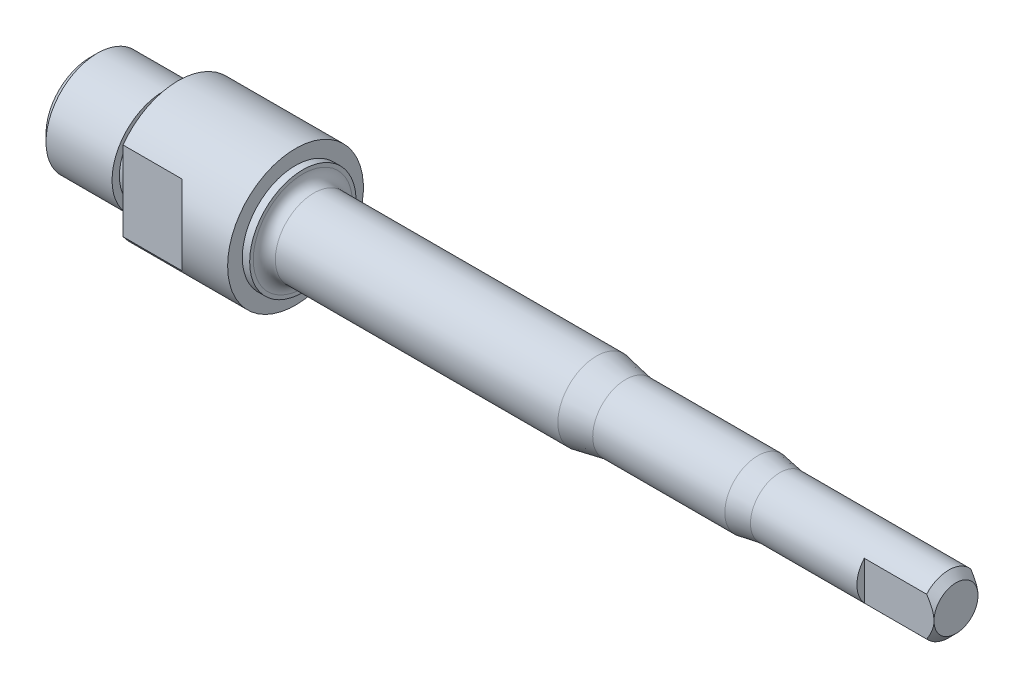
ISO-10303-21;
HEADER;
FILE_DESCRIPTION(('STEP AP214'),'2;1');
FILE_NAME('part.step','',(''),(''),'','','');
FILE_SCHEMA(('AUTOMOTIVE_DESIGN { 1 0 10303 214 1 1 1 1 }'));
ENDSEC;
DATA;
#1=APPLICATION_CONTEXT('core data for automotive mechanical design processes');
#2=APPLICATION_PROTOCOL_DEFINITION('international standard','automotive_design',2000,#1);
#3=PRODUCT_CONTEXT('',#1,'mechanical');
#4=PRODUCT('Part','Part','',(#3));
#5=PRODUCT_RELATED_PRODUCT_CATEGORY('part','',(#4));
#6=PRODUCT_DEFINITION_FORMATION('','',#4);
#7=PRODUCT_DEFINITION_CONTEXT('part definition',#1,'design');
#8=PRODUCT_DEFINITION('design','',#6,#7);
#9=PRODUCT_DEFINITION_SHAPE('','',#8);
#10=(LENGTH_UNIT() NAMED_UNIT(*) SI_UNIT(.MILLI.,.METRE.));
#11=(NAMED_UNIT(*) PLANE_ANGLE_UNIT() SI_UNIT($,.RADIAN.));
#12=(NAMED_UNIT(*) SI_UNIT($,.STERADIAN.) SOLID_ANGLE_UNIT());
#13=UNCERTAINTY_MEASURE_WITH_UNIT(LENGTH_MEASURE(1.E-05),#10,'distance_accuracy_value','');
#14=(GEOMETRIC_REPRESENTATION_CONTEXT(3) GLOBAL_UNCERTAINTY_ASSIGNED_CONTEXT((#13)) GLOBAL_UNIT_ASSIGNED_CONTEXT((#10,
#11,#12)) REPRESENTATION_CONTEXT('',''));
#15=CARTESIAN_POINT('',(0.,0.,0.));
#16=DIRECTION('',(0.,0.,1.));
#17=DIRECTION('',(1.,0.,0.));
#18=AXIS2_PLACEMENT_3D('',#15,#16,#17);
#19=CARTESIAN_POINT('',(86.4999999999999,0.,0.));
#20=DIRECTION('',(-1.,0.,0.));
#21=DIRECTION('',(0.,0.,1.));
#22=AXIS2_PLACEMENT_3D('',#19,#20,#21);
#23=CONICAL_SURFACE('',#22,4.,0.785398163397453);
#24=CARTESIAN_POINT('',(83.9454805426856,-5.82766894360967,3.));
#25=CARTESIAN_POINT('',(84.0655117039438,-5.69264565157083,3.));
#26=CARTESIAN_POINT('',(84.1850770622661,-5.55720424751878,3.));
#27=CARTESIAN_POINT('',(84.4230267177159,-5.28526281263326,3.));
#28=CARTESIAN_POINT('',(84.5414108863103,-5.14876266940287,3.));
#29=CARTESIAN_POINT('',(84.7772393619955,-4.87390823263204,3.));
#30=CARTESIAN_POINT('',(84.8946772598605,-4.73554842944571,3.));
#31=CARTESIAN_POINT('',(85.1276999950873,-4.45728579803167,3.));
#32=CARTESIAN_POINT('',(85.2432849228771,-4.31738304566825,3.));
#33=CARTESIAN_POINT('',(85.478812959821,-4.02739354649278,3.));
#34=CARTESIAN_POINT('',(85.598613830107,-3.87719092138411,3.));
#35=CARTESIAN_POINT('',(85.8347159451541,-3.57406261021565,3.));
#36=CARTESIAN_POINT('',(85.9510174160533,-3.42113710113499,3.));
#37=CARTESIAN_POINT('',(86.1786704812191,-3.1120425837193,3.));
#38=CARTESIAN_POINT('',(86.2900304211284,-2.95587975274407,3.));
#39=CARTESIAN_POINT('',(86.5061129213863,-2.63905224451841,3.));
#40=CARTESIAN_POINT('',(86.6108378920116,-2.47838923298491,3.));
#41=CARTESIAN_POINT('',(86.7802481254026,-2.20105121720574,3.));
#42=CARTESIAN_POINT('',(86.8474079714238,-2.08589532077437,3.));
#43=CARTESIAN_POINT('',(86.9756601830143,-1.85216902016114,3.));
#44=CARTESIAN_POINT('',(87.0367506631882,-1.7335975696306,3.));
#45=CARTESIAN_POINT('',(87.1504084691463,-1.49359958600334,3.));
#46=CARTESIAN_POINT('',(87.2030424688,-1.37220500859752,3.));
#47=CARTESIAN_POINT('',(87.297880296644,-1.12539482873997,3.));
#48=CARTESIAN_POINT('',(87.3400907101594,-0.999981821896806,3.));
#49=CARTESIAN_POINT('',(87.4000014211144,-0.78549501012344,3.));
#50=CARTESIAN_POINT('',(87.4212344978726,-0.697409804346162,3.));
#51=CARTESIAN_POINT('',(87.4565422822498,-0.519807167805163,3.));
#52=CARTESIAN_POINT('',(87.470618225964,-0.430289987111685,3.));
#53=CARTESIAN_POINT('',(87.4908705414782,-0.250605005367684,3.));
#54=CARTESIAN_POINT('',(87.4970686878801,-0.160439693507881,3.));
#55=CARTESIAN_POINT('',(87.5012899575232,0.0200867484580853,3.));
#56=CARTESIAN_POINT('',(87.4993129845487,0.110447880856414,3.));
#57=CARTESIAN_POINT('',(87.4873085074553,0.290452475938859,3.));
#58=CARTESIAN_POINT('',(87.477296288223,0.380096975143133,3.));
#59=CARTESIAN_POINT('',(87.449775132821,0.558232140308298,3.));
#60=CARTESIAN_POINT('',(87.4322643905162,0.646722522987505,3.));
#61=CARTESIAN_POINT('',(87.3904884108286,0.822421138374674,3.));
#62=CARTESIAN_POINT('',(87.366198331527,0.909623389360495,3.));
#63=CARTESIAN_POINT('',(87.3118329160716,1.08218205018663,3.));
#64=CARTESIAN_POINT('',(87.2817576187198,1.1675384724028,3.));
#65=CARTESIAN_POINT('',(87.2066520762065,1.36255972060941,3.));
#66=CARTESIAN_POINT('',(87.159877058565,1.47154946468157,3.));
#67=CARTESIAN_POINT('',(87.0597659733652,1.68649433196525,3.));
#68=CARTESIAN_POINT('',(87.0064265873104,1.79244788664412,3.));
#69=CARTESIAN_POINT('',(86.8945308045118,2.00181172191159,3.));
#70=CARTESIAN_POINT('',(86.8359642993992,2.10521655865774,3.));
#71=CARTESIAN_POINT('',(86.7148259575276,2.30961365299051,3.));
#72=CARTESIAN_POINT('',(86.652254777012,2.41060630215502,3.));
#73=CARTESIAN_POINT('',(86.5230184328464,2.61197774335552,3.));
#74=CARTESIAN_POINT('',(86.456307443454,2.71232698806034,3.));
#75=CARTESIAN_POINT('',(86.3202797197868,2.91124115726205,3.));
#76=CARTESIAN_POINT('',(86.2509629040596,3.0098060258404,3.));
#77=CARTESIAN_POINT('',(86.1103135824185,3.20530008376468,3.));
#78=CARTESIAN_POINT('',(86.0389836401163,3.30223112276453,3.));
#79=CARTESIAN_POINT('',(85.8946133783344,3.49480227644268,3.));
#80=CARTESIAN_POINT('',(85.8215731222739,3.59044243878072,3.));
#81=CARTESIAN_POINT('',(85.6598676336843,3.79894899514702,3.));
#82=CARTESIAN_POINT('',(85.5709036918906,3.91158345219042,3.));
#83=CARTESIAN_POINT('',(85.3913495743201,4.13555016737936,3.));
#84=CARTESIAN_POINT('',(85.300759354629,4.24688239022613,3.));
#85=CARTESIAN_POINT('',(85.0269894414613,4.57927058312825,3.));
#86=CARTESIAN_POINT('',(84.8418288895765,4.79869462587923,3.));
#87=CARTESIAN_POINT('',(84.4677976085745,5.2344919346645,3.));
#88=CARTESIAN_POINT('',(84.2789254200242,5.4508639407618,3.));
#89=CARTESIAN_POINT('',(83.898538716472,5.88127733851658,3.));
#90=CARTESIAN_POINT('',(83.707024143851,6.09531867916962,3.));
#91=CARTESIAN_POINT('',(83.3216521517571,6.52204578608344,3.));
#92=CARTESIAN_POINT('',(83.127790854936,6.73472804400077,3.));
#93=CARTESIAN_POINT('',(82.738554247134,7.15870603721351,3.));
#94=CARTESIAN_POINT('',(82.5431789164822,7.37000175442835,3.));
#95=CARTESIAN_POINT('',(81.9554010551541,8.00215026496753,3.));
#96=CARTESIAN_POINT('',(81.5612471563063,8.42137383524303,3.));
#97=CARTESIAN_POINT('',(80.8166398863339,9.20767583522379,3.));
#98=CARTESIAN_POINT('',(80.4665185131119,9.5750696848794,3.));
#99=CARTESIAN_POINT('',(79.7645726387693,10.3082794985872,3.));
#100=CARTESIAN_POINT('',(79.4127480111471,10.6740953415027,3.));
#101=CARTESIAN_POINT('',(78.7090573295836,11.4033091898684,3.));
#102=CARTESIAN_POINT('',(78.3571954099332,11.7667111889158,3.));
#103=CARTESIAN_POINT('',(77.6525557400455,12.4925661629935,3.));
#104=CARTESIAN_POINT('',(77.2997780705663,12.8550192164019,3.));
#105=CARTESIAN_POINT('',(76.9466649031287,13.217143876348,3.));
#106=B_SPLINE_CURVE_WITH_KNOTS('',3,(#24,#25,#26,#27,#28,#29,#30,#31,#32,#33,#34,#35,#36,#37,
#38,#39,#40,#41,#42,#43,#44,#45,#46,#47,#48,#49,#50,#51,#52,#53,#54,#55,#56,#57,#58,#59,#60,#61,
#62,#63,#64,#65,#66,#67,#68,#69,#70,#71,#72,#73,#74,#75,#76,#77,#78,#79,#80,#81,#82,#83,#84,#85,
#86,#87,#88,#89,#90,#91,#92,#93,#94,#95,#96,#97,#98,#99,#100,#101,#102,#103,#104,#105),
.UNSPECIFIED.,.F.,.F.,(4,2,2,2,2,2,2,2,2,2,2,2,2,2,2,2,2,2,2,2,2,2,2,2,2,2,2,2,2,2,2,2,2,2,2,2,
2,2,2,2,4),(0.,0.541989497215121,1.08403734239201,1.62846524927109,2.17286650581258,
2.74921195485771,3.3255200789771,3.90081464769184,4.47589901724461,4.87569159278189,
5.27560797459741,5.672197581955,6.06853599056226,6.34010826464294,6.61163362002952,
6.88240682272138,7.15318321223966,7.42344574019039,7.69377340168833,7.96510494845388,
8.23643467543905,8.59195180149544,8.94764939675426,9.30405040632841,9.66039316150135,
10.0218435300452,10.3833052061351,10.7443256841453,11.1053327964599,11.5359059415831,
11.9664907310312,12.8277497007739,13.6893543801825,14.5509778772609,15.4143015886377,
16.277636535527,18.0038627797252,19.5263781829786,21.0490084541624,22.5665080627569,
24.0838781081661),.UNSPECIFIED.);
#107=CARTESIAN_POINT('',(86.4999999999999,-2.64575131106512,3.));
#108=VERTEX_POINT('',#107);
#109=CARTESIAN_POINT('',(87.5,0.,2.99999999999996));
#110=VERTEX_POINT('',#109);
#111=EDGE_CURVE('E191',#108,#110,#106,.T.);
#112=ORIENTED_EDGE('',*,*,#111,.F.);
#113=CARTESIAN_POINT('',(86.4999999999999,0.,0.));
#114=DIRECTION('',(-1.,0.,0.));
#115=DIRECTION('',(0.,0.,1.));
#116=AXIS2_PLACEMENT_3D('',#113,#114,#115);
#117=CIRCLE('',#116,4.);
#118=CARTESIAN_POINT('',(86.4999999999999,-2.64575131106512,-3.));
#119=VERTEX_POINT('',#118);
#120=EDGE_CURVE('E149',#119,#108,#117,.T.);
#121=ORIENTED_EDGE('',*,*,#120,.F.);
#122=CARTESIAN_POINT('',(83.9454805426856,-5.82766894360967,-3.));
#123=CARTESIAN_POINT('',(84.0655117039438,-5.69264565157083,-3.));
#124=CARTESIAN_POINT('',(84.1850770622661,-5.55720424751878,-3.));
#125=CARTESIAN_POINT('',(84.4230267177159,-5.28526281263325,-3.));
#126=CARTESIAN_POINT('',(84.5414108863103,-5.14876266940287,-3.));
#127=CARTESIAN_POINT('',(84.7772393619955,-4.87390823263204,-3.));
#128=CARTESIAN_POINT('',(84.8946772598605,-4.73554842944571,-3.));
#129=CARTESIAN_POINT('',(85.1276999950873,-4.45728579803167,-3.));
#130=CARTESIAN_POINT('',(85.2432849228771,-4.31738304566825,-3.));
#131=CARTESIAN_POINT('',(85.478812959821,-4.02739354649278,-3.));
#132=CARTESIAN_POINT('',(85.598613830107,-3.87719092138411,-3.));
#133=CARTESIAN_POINT('',(85.8347159451541,-3.57406261021564,-3.));
#134=CARTESIAN_POINT('',(85.9510174160533,-3.42113710113499,-3.));
#135=CARTESIAN_POINT('',(86.1786704812191,-3.1120425837193,-3.));
#136=CARTESIAN_POINT('',(86.2900304211284,-2.95587975274407,-3.));
#137=CARTESIAN_POINT('',(86.5061129213863,-2.63905224451841,-3.));
#138=CARTESIAN_POINT('',(86.6108378920116,-2.47838923298491,-3.));
#139=CARTESIAN_POINT('',(86.7802481254026,-2.20105121720574,-3.));
#140=CARTESIAN_POINT('',(86.8474079714238,-2.08589532077437,-3.));
#141=CARTESIAN_POINT('',(86.9756601830143,-1.85216902016113,-3.));
#142=CARTESIAN_POINT('',(87.0367506631882,-1.7335975696306,-3.));
#143=CARTESIAN_POINT('',(87.1504084691463,-1.49359958600334,-3.));
#144=CARTESIAN_POINT('',(87.2030424688,-1.37220500859752,-3.));
#145=CARTESIAN_POINT('',(87.297880296644,-1.12539482873996,-3.));
#146=CARTESIAN_POINT('',(87.3400907101594,-0.999981821896806,-3.));
#147=CARTESIAN_POINT('',(87.4000014211144,-0.785495010123441,-3.));
#148=CARTESIAN_POINT('',(87.4212344978726,-0.697409804346162,-3.));
#149=CARTESIAN_POINT('',(87.4565422822498,-0.519807167805163,-3.));
#150=CARTESIAN_POINT('',(87.470618225964,-0.430289987111685,-3.));
#151=CARTESIAN_POINT('',(87.4908705414782,-0.250605005367685,-3.));
#152=CARTESIAN_POINT('',(87.4970686878801,-0.160439693507882,-3.));
#153=CARTESIAN_POINT('',(87.5012899575232,0.0200867484580848,-3.));
#154=CARTESIAN_POINT('',(87.4993129845487,0.110447880856413,-3.));
#155=CARTESIAN_POINT('',(87.4873085074553,0.290452475938859,-3.));
#156=CARTESIAN_POINT('',(87.477296288223,0.380096975143132,-3.));
#157=CARTESIAN_POINT('',(87.449775132821,0.558232140308297,-3.));
#158=CARTESIAN_POINT('',(87.4322643905162,0.646722522987503,-3.));
#159=CARTESIAN_POINT('',(87.3904884108286,0.822421138374673,-3.));
#160=CARTESIAN_POINT('',(87.366198331527,0.909623389360494,-3.));
#161=CARTESIAN_POINT('',(87.3118329160716,1.08218205018663,-3.));
#162=CARTESIAN_POINT('',(87.2817576187198,1.1675384724028,-3.));
#163=CARTESIAN_POINT('',(87.2066520762065,1.36255972060941,-3.));
#164=CARTESIAN_POINT('',(87.159877058565,1.47154946468156,-3.));
#165=CARTESIAN_POINT('',(87.0597659733652,1.68649433196525,-3.));
#166=CARTESIAN_POINT('',(87.0064265873104,1.79244788664412,-3.));
#167=CARTESIAN_POINT('',(86.8945308045118,2.00181172191159,-3.));
#168=CARTESIAN_POINT('',(86.8359642993992,2.10521655865774,-3.));
#169=CARTESIAN_POINT('',(86.7148259575276,2.30961365299051,-3.));
#170=CARTESIAN_POINT('',(86.652254777012,2.41060630215502,-3.));
#171=CARTESIAN_POINT('',(86.5230184328464,2.61197774335551,-3.));
#172=CARTESIAN_POINT('',(86.456307443454,2.71232698806033,-3.));
#173=CARTESIAN_POINT('',(86.3202797197868,2.91124115726205,-3.));
#174=CARTESIAN_POINT('',(86.2509629040596,3.00980602584039,-3.));
#175=CARTESIAN_POINT('',(86.1103135824185,3.20530008376468,-3.));
#176=CARTESIAN_POINT('',(86.0389836401163,3.30223112276453,-3.));
#177=CARTESIAN_POINT('',(85.8946133783344,3.49480227644268,-3.));
#178=CARTESIAN_POINT('',(85.8215731222739,3.59044243878072,-3.));
#179=CARTESIAN_POINT('',(85.6598676336843,3.79894899514702,-3.));
#180=CARTESIAN_POINT('',(85.5709036918906,3.91158345219042,-3.));
#181=CARTESIAN_POINT('',(85.3913495743201,4.13555016737936,-3.));
#182=CARTESIAN_POINT('',(85.300759354629,4.24688239022613,-3.));
#183=CARTESIAN_POINT('',(85.0269894414613,4.57927058312825,-3.));
#184=CARTESIAN_POINT('',(84.8418288895765,4.79869462587923,-3.));
#185=CARTESIAN_POINT('',(84.4677976085745,5.2344919346645,-3.));
#186=CARTESIAN_POINT('',(84.2789254200242,5.45086394076181,-3.));
#187=CARTESIAN_POINT('',(83.898538716472,5.88127733851659,-3.));
#188=CARTESIAN_POINT('',(83.707024143851,6.09531867916962,-3.));
#189=CARTESIAN_POINT('',(83.3216521517571,6.52204578608344,-3.));
#190=CARTESIAN_POINT('',(83.127790854936,6.73472804400077,-3.));
#191=CARTESIAN_POINT('',(82.738554247134,7.15870603721351,-3.));
#192=CARTESIAN_POINT('',(82.5431789164822,7.37000175442835,-3.));
#193=CARTESIAN_POINT('',(81.9554010551541,8.00215026496752,-3.));
#194=CARTESIAN_POINT('',(81.5612471563063,8.42137383524302,-3.));
#195=CARTESIAN_POINT('',(80.8166398863339,9.20767583522379,-3.));
#196=CARTESIAN_POINT('',(80.4665185131119,9.57506968487941,-3.));
#197=CARTESIAN_POINT('',(79.7645726387693,10.3082794985872,-3.));
#198=CARTESIAN_POINT('',(79.4127480111471,10.6740953415027,-3.));
#199=CARTESIAN_POINT('',(78.7090573295836,11.4033091898684,-3.));
#200=CARTESIAN_POINT('',(78.3571954099332,11.7667111889158,-3.));
#201=CARTESIAN_POINT('',(77.6525557400455,12.4925661629935,-3.));
#202=CARTESIAN_POINT('',(77.2997780705663,12.8550192164019,-3.));
#203=CARTESIAN_POINT('',(76.9466649031287,13.217143876348,-3.));
#204=B_SPLINE_CURVE_WITH_KNOTS('',3,(#122,#123,#124,#125,#126,#127,#128,#129,#130,#131,#132,
#133,#134,#135,#136,#137,#138,#139,#140,#141,#142,#143,#144,#145,#146,#147,#148,#149,#150,#151,
#152,#153,#154,#155,#156,#157,#158,#159,#160,#161,#162,#163,#164,#165,#166,#167,#168,#169,#170,
#171,#172,#173,#174,#175,#176,#177,#178,#179,#180,#181,#182,#183,#184,#185,#186,#187,#188,#189,
#190,#191,#192,#193,#194,#195,#196,#197,#198,#199,#200,#201,#202,#203),.UNSPECIFIED.,.F.,.F.,(4,
2,2,2,2,2,2,2,2,2,2,2,2,2,2,2,2,2,2,2,2,2,2,2,2,2,2,2,2,2,2,2,2,2,2,2,2,2,2,2,4),(0.,
0.541989497215122,1.08403734239201,1.62846524927109,2.17286650581258,2.74921195485771,
3.3255200789771,3.90081464769184,4.47589901724461,4.87569159278189,5.27560797459741,
5.672197581955,6.06853599056226,6.34010826464294,6.61163362002952,6.88240682272138,
7.15318321223966,7.42344574019039,7.69377340168833,7.96510494845388,8.23643467543905,
8.59195180149544,8.94764939675426,9.30405040632841,9.66039316150135,10.0218435300452,
10.3833052061351,10.7443256841453,11.1053327964599,11.5359059415831,11.9664907310312,
12.8277497007739,13.6893543801825,14.5509778772609,15.4143015886377,16.277636535527,
18.0038627797252,19.5263781829786,21.0490084541623,22.5665080627569,24.0838781081661),.UNSPECIFIED.);
#205=CARTESIAN_POINT('',(87.5,0.,-3.));
#206=VERTEX_POINT('',#205);
#207=EDGE_CURVE('E162',#206,#119,#204,.F.);
#208=ORIENTED_EDGE('',*,*,#207,.F.);
#209=CARTESIAN_POINT('',(87.5,0.,0.));
#210=DIRECTION('',(-1.,0.,0.));
#211=DIRECTION('',(0.,0.,1.));
#212=AXIS2_PLACEMENT_3D('',#209,#210,#211);
#213=CIRCLE('',#212,2.99999999999996);
#214=EDGE_CURVE('E152',#110,#206,#213,.F.);
#215=ORIENTED_EDGE('',*,*,#214,.F.);
#216=EDGE_LOOP('',(#112,#121,#208,#215));
#217=FACE_BOUND('',#216,.T.);
#218=ADVANCED_FACE('F27',(#217),#23,.T.);
#219=CARTESIAN_POINT('',(87.5,3.99999999999998,0.));
#220=DIRECTION('',(-1.,0.,0.));
#221=DIRECTION('',(0.,0.,1.));
#222=AXIS2_PLACEMENT_3D('',#219,#220,#221);
#223=PLANE('',#222);
#224=EDGE_CURVE('E153',#206,#110,#213,.F.);
#225=ORIENTED_EDGE('',*,*,#224,.T.);
#226=ORIENTED_EDGE('',*,*,#214,.T.);
#227=EDGE_LOOP('',(#225,#226));
#228=FACE_BOUND('',#227,.T.);
#229=ADVANCED_FACE('F29',(#228),#223,.F.);
#230=CARTESIAN_POINT('',(-56.1362564152118,-1.11022302462516E-13,0.));
#231=DIRECTION('',(-1.,0.,0.));
#232=DIRECTION('',(0.,0.,1.));
#233=AXIS2_PLACEMENT_3D('',#230,#231,#232);
#234=CYLINDRICAL_SURFACE('',#233,4.);
#235=DIRECTION('',(-1.,0.,0.));
#236=VECTOR('',#235,1.);
#237=CARTESIAN_POINT('',(-56.1362564152118,-2.6457513110647,3.));
#238=LINE('',#237,#236);
#239=CARTESIAN_POINT('',(78.,-2.64575131106459,3.));
#240=VERTEX_POINT('',#239);
#241=EDGE_CURVE('E236',#108,#240,#238,.T.);
#242=ORIENTED_EDGE('',*,*,#241,.T.);
#243=CARTESIAN_POINT('',(78.,0.,0.));
#244=DIRECTION('',(-1.,0.,0.));
#245=DIRECTION('',(0.,0.,1.));
#246=AXIS2_PLACEMENT_3D('',#243,#244,#245);
#247=CIRCLE('',#246,4.);
#248=CARTESIAN_POINT('',(78.,2.64575131106459,3.));
#249=VERTEX_POINT('',#248);
#250=EDGE_CURVE('E192',#240,#249,#247,.T.);
#251=ORIENTED_EDGE('',*,*,#250,.T.);
#252=DIRECTION('',(-1.,0.,0.));
#253=VECTOR('',#252,1.);
#254=CARTESIAN_POINT('',(-56.1362564152118,2.64575131106448,3.));
#255=LINE('',#254,#253);
#256=CARTESIAN_POINT('',(86.4999999999999,2.64575131106459,3.));
#257=VERTEX_POINT('',#256);
#258=EDGE_CURVE('E371',#249,#257,#255,.F.);
#259=ORIENTED_EDGE('',*,*,#258,.T.);
#260=CARTESIAN_POINT('',(86.4999999999999,2.64575131106459,-3.));
#261=VERTEX_POINT('',#260);
#262=EDGE_CURVE('E148',#257,#261,#117,.T.);
#263=ORIENTED_EDGE('',*,*,#262,.T.);
#264=DIRECTION('',(-1.,0.,0.));
#265=VECTOR('',#264,1.);
#266=CARTESIAN_POINT('',(-56.1362564152118,2.64575131106448,-3.));
#267=LINE('',#266,#265);
#268=CARTESIAN_POINT('',(78.,2.64575131106459,-3.));
#269=VERTEX_POINT('',#268);
#270=EDGE_CURVE('E243',#261,#269,#267,.T.);
#271=ORIENTED_EDGE('',*,*,#270,.T.);
#272=CARTESIAN_POINT('',(78.,0.,0.));
#273=DIRECTION('',(-1.,0.,0.));
#274=DIRECTION('',(0.,0.,1.));
#275=AXIS2_PLACEMENT_3D('',#272,#273,#274);
#276=CIRCLE('',#275,4.);
#277=CARTESIAN_POINT('',(78.,-2.64575131106459,-3.));
#278=VERTEX_POINT('',#277);
#279=EDGE_CURVE('E170',#269,#278,#276,.T.);
#280=ORIENTED_EDGE('',*,*,#279,.T.);
#281=DIRECTION('',(-1.,0.,0.));
#282=VECTOR('',#281,1.);
#283=CARTESIAN_POINT('',(-56.1362564152118,-2.6457513110647,-3.));
#284=LINE('',#283,#282);
#285=EDGE_CURVE('E238',#278,#119,#284,.F.);
#286=ORIENTED_EDGE('',*,*,#285,.T.);
#287=ORIENTED_EDGE('',*,*,#120,.T.);
#288=EDGE_LOOP('',(#242,#251,#259,#263,#271,#280,#286,#287));
#289=FACE_BOUND('',#288,.T.);
#290=CARTESIAN_POINT('',(63.5,0.,0.));
#291=DIRECTION('',(-1.,0.,0.));
#292=DIRECTION('',(0.,0.,1.));
#293=AXIS2_PLACEMENT_3D('',#290,#291,#292);
#294=CIRCLE('',#293,4.);
#295=CARTESIAN_POINT('',(63.5,0.,4.));
#296=VERTEX_POINT('',#295);
#297=EDGE_CURVE('E145',#296,#296,#294,.T.);
#298=ORIENTED_EDGE('',*,*,#297,.F.);
#299=EDGE_LOOP('',(#298));
#300=FACE_BOUND('',#299,.T.);
#301=ADVANCED_FACE('F224',(#289,#300),#234,.T.);
#302=CARTESIAN_POINT('',(63.5,0.,0.));
#303=DIRECTION('',(-1.,0.,0.));
#304=DIRECTION('',(0.,0.,1.));
#305=AXIS2_PLACEMENT_3D('',#302,#303,#304);
#306=CONICAL_SURFACE('',#305,4.,0.165148677414626);
#307=CARTESIAN_POINT('',(60.5,0.,0.));
#308=DIRECTION('',(-1.,0.,0.));
#309=DIRECTION('',(0.,0.,1.));
#310=AXIS2_PLACEMENT_3D('',#307,#308,#309);
#311=CIRCLE('',#310,4.5);
#312=CARTESIAN_POINT('',(60.5,0.,4.5));
#313=VERTEX_POINT('',#312);
#314=EDGE_CURVE('E142',#313,#313,#311,.T.);
#315=ORIENTED_EDGE('',*,*,#314,.F.);
#316=EDGE_LOOP('',(#315));
#317=FACE_BOUND('',#316,.T.);
#318=ORIENTED_EDGE('',*,*,#297,.T.);
#319=EDGE_LOOP('',(#318));
#320=FACE_BOUND('',#319,.T.);
#321=ADVANCED_FACE('F300',(#317,#320),#306,.T.);
#322=CARTESIAN_POINT('',(-56.1362564152118,-1.11022302462516E-13,0.));
#323=DIRECTION('',(-1.,0.,0.));
#324=DIRECTION('',(0.,0.,1.));
#325=AXIS2_PLACEMENT_3D('',#322,#323,#324);
#326=CYLINDRICAL_SURFACE('',#325,4.5);
#327=CARTESIAN_POINT('',(42.5,0.,0.));
#328=DIRECTION('',(-1.,0.,0.));
#329=DIRECTION('',(0.,0.,1.));
#330=AXIS2_PLACEMENT_3D('',#327,#328,#329);
#331=CIRCLE('',#330,4.5);
#332=CARTESIAN_POINT('',(42.5,0.,4.5));
#333=VERTEX_POINT('',#332);
#334=EDGE_CURVE('E139',#333,#333,#331,.T.);
#335=ORIENTED_EDGE('',*,*,#334,.F.);
#336=EDGE_LOOP('',(#335));
#337=FACE_BOUND('',#336,.T.);
#338=ORIENTED_EDGE('',*,*,#314,.T.);
#339=EDGE_LOOP('',(#338));
#340=FACE_BOUND('',#339,.T.);
#341=ADVANCED_FACE('F296',(#337,#340),#326,.T.);
#342=CARTESIAN_POINT('',(42.5,0.,0.));
#343=DIRECTION('',(-1.,0.,0.));
#344=DIRECTION('',(0.,0.,1.));
#345=AXIS2_PLACEMENT_3D('',#342,#343,#344);
#346=CONICAL_SURFACE('',#345,4.5,0.185347949995695);
#347=CARTESIAN_POINT('',(38.5,0.,0.));
#348=DIRECTION('',(-1.,0.,0.));
#349=DIRECTION('',(0.,0.,1.));
#350=AXIS2_PLACEMENT_3D('',#347,#348,#349);
#351=CIRCLE('',#350,5.25);
#352=CARTESIAN_POINT('',(38.5,0.,5.25));
#353=VERTEX_POINT('',#352);
#354=EDGE_CURVE('E136',#353,#353,#351,.T.);
#355=ORIENTED_EDGE('',*,*,#354,.F.);
#356=EDGE_LOOP('',(#355));
#357=FACE_BOUND('',#356,.T.);
#358=ORIENTED_EDGE('',*,*,#334,.T.);
#359=EDGE_LOOP('',(#358));
#360=FACE_BOUND('',#359,.T.);
#361=ADVANCED_FACE('F292',(#357,#360),#346,.T.);
#362=CARTESIAN_POINT('',(-56.1362564152118,-1.11022302462516E-13,0.));
#363=DIRECTION('',(-1.,0.,0.));
#364=DIRECTION('',(0.,0.,1.));
#365=AXIS2_PLACEMENT_3D('',#362,#363,#364);
#366=CYLINDRICAL_SURFACE('',#365,5.25);
#367=CARTESIAN_POINT('',(0.,0.,0.));
#368=DIRECTION('',(-1.,0.,0.));
#369=DIRECTION('',(0.,0.,1.));
#370=AXIS2_PLACEMENT_3D('',#367,#368,#369);
#371=CIRCLE('',#370,5.25);
#372=CARTESIAN_POINT('',(0.,0.,5.25));
#373=VERTEX_POINT('',#372);
#374=EDGE_CURVE('E133',#373,#373,#371,.T.);
#375=ORIENTED_EDGE('',*,*,#374,.F.);
#376=EDGE_LOOP('',(#375));
#377=FACE_BOUND('',#376,.T.);
#378=ORIENTED_EDGE('',*,*,#354,.T.);
#379=EDGE_LOOP('',(#378));
#380=FACE_BOUND('',#379,.T.);
#381=ADVANCED_FACE('F288',(#377,#380),#366,.T.);
#382=CARTESIAN_POINT('',(0.,0.,0.));
#383=DIRECTION('',(-1.,0.,0.));
#384=DIRECTION('',(0.,0.,1.));
#385=AXIS2_PLACEMENT_3D('',#382,#383,#384);
#386=TOROIDAL_SURFACE('',#385,6.75,1.5);
#387=CARTESIAN_POINT('',(-1.5,-1.11022302462516E-13,0.));
#388=DIRECTION('',(-1.,0.,0.));
#389=DIRECTION('',(0.,0.,1.));
#390=AXIS2_PLACEMENT_3D('',#387,#388,#389);
#391=CIRCLE('',#390,6.75);
#392=CARTESIAN_POINT('',(-1.5,-1.11022302462516E-13,6.75));
#393=VERTEX_POINT('',#392);
#394=EDGE_CURVE('E130',#393,#393,#391,.T.);
#395=ORIENTED_EDGE('',*,*,#394,.F.);
#396=EDGE_LOOP('',(#395));
#397=FACE_BOUND('',#396,.T.);
#398=ORIENTED_EDGE('',*,*,#374,.T.);
#399=EDGE_LOOP('',(#398));
#400=FACE_BOUND('',#399,.T.);
#401=ADVANCED_FACE('F284',(#397,#400),#386,.F.);
#402=CARTESIAN_POINT('',(-1.5,7.2499999999999,0.));
#403=DIRECTION('',(-1.,0.,0.));
#404=DIRECTION('',(0.,0.,1.));
#405=AXIS2_PLACEMENT_3D('',#402,#403,#404);
#406=PLANE('',#405);
#407=CARTESIAN_POINT('',(-1.5,-1.11022302462516E-13,0.));
#408=DIRECTION('',(-1.,0.,0.));
#409=DIRECTION('',(0.,0.,1.));
#410=AXIS2_PLACEMENT_3D('',#407,#408,#409);
#411=CIRCLE('',#410,7.25);
#412=CARTESIAN_POINT('',(-1.5,-1.11022302462516E-13,7.25));
#413=VERTEX_POINT('',#412);
#414=EDGE_CURVE('E127',#413,#413,#411,.T.);
#415=ORIENTED_EDGE('',*,*,#414,.F.);
#416=EDGE_LOOP('',(#415));
#417=FACE_BOUND('',#416,.T.);
#418=ORIENTED_EDGE('',*,*,#394,.T.);
#419=EDGE_LOOP('',(#418));
#420=FACE_BOUND('',#419,.T.);
#421=ADVANCED_FACE('F280',(#417,#420),#406,.F.);
#422=CARTESIAN_POINT('',(-56.1362564152118,-1.11022302462516E-13,0.));
#423=DIRECTION('',(-1.,0.,0.));
#424=DIRECTION('',(0.,0.,1.));
#425=AXIS2_PLACEMENT_3D('',#422,#423,#424);
#426=CYLINDRICAL_SURFACE('',#425,7.25);
#427=CARTESIAN_POINT('',(-2.5,-1.11022302462516E-13,0.));
#428=DIRECTION('',(-1.,0.,0.));
#429=DIRECTION('',(0.,0.,1.));
#430=AXIS2_PLACEMENT_3D('',#427,#428,#429);
#431=CIRCLE('',#430,7.25);
#432=CARTESIAN_POINT('',(-2.5,-1.11022302462516E-13,7.25));
#433=VERTEX_POINT('',#432);
#434=EDGE_CURVE('E119',#433,#433,#431,.T.);
#435=ORIENTED_EDGE('',*,*,#434,.F.);
#436=EDGE_LOOP('',(#435));
#437=FACE_BOUND('',#436,.T.);
#438=ORIENTED_EDGE('',*,*,#414,.T.);
#439=EDGE_LOOP('',(#438));
#440=FACE_BOUND('',#439,.T.);
#441=ADVANCED_FACE('F276',(#437,#440),#426,.T.);
#442=CARTESIAN_POINT('',(-2.5,9.2499999999999,0.));
#443=DIRECTION('',(-1.,0.,0.));
#444=DIRECTION('',(0.,0.,1.));
#445=AXIS2_PLACEMENT_3D('',#442,#443,#444);
#446=PLANE('',#445);
#447=CARTESIAN_POINT('',(-2.5,-1.11022302462516E-13,0.));
#448=DIRECTION('',(-1.,0.,0.));
#449=DIRECTION('',(0.,0.,1.));
#450=AXIS2_PLACEMENT_3D('',#447,#448,#449);
#451=CIRCLE('',#450,9.25);
#452=CARTESIAN_POINT('',(-2.5,-1.11022302462516E-13,9.25));
#453=VERTEX_POINT('',#452);
#454=EDGE_CURVE('E115',#453,#453,#451,.T.);
#455=ORIENTED_EDGE('',*,*,#454,.F.);
#456=EDGE_LOOP('',(#455));
#457=FACE_BOUND('',#456,.T.);
#458=ORIENTED_EDGE('',*,*,#434,.T.);
#459=EDGE_LOOP('',(#458));
#460=FACE_BOUND('',#459,.T.);
#461=ADVANCED_FACE('F270',(#457,#460),#446,.F.);
#462=CARTESIAN_POINT('',(-56.1362564152118,-1.11022302462516E-13,0.));
#463=DIRECTION('',(-1.,0.,0.));
#464=DIRECTION('',(0.,0.,1.));
#465=AXIS2_PLACEMENT_3D('',#462,#463,#464);
#466=CYLINDRICAL_SURFACE('',#465,9.25);
#467=CARTESIAN_POINT('',(-18.5,-1.11022302462516E-13,0.));
#468=DIRECTION('',(-1.,0.,0.));
#469=DIRECTION('',(0.,0.,1.));
#470=AXIS2_PLACEMENT_3D('',#467,#468,#469);
#471=CIRCLE('',#470,9.25);
#472=CARTESIAN_POINT('',(-18.5000000000001,5.41410195692682,7.5));
#473=VERTEX_POINT('',#472);
#474=CARTESIAN_POINT('',(-18.5000000000001,5.41410195692682,-7.5));
#475=VERTEX_POINT('',#474);
#476=EDGE_CURVE('E116',#473,#475,#471,.T.);
#477=ORIENTED_EDGE('',*,*,#476,.F.);
#478=DIRECTION('',(-1.,0.,0.));
#479=VECTOR('',#478,1.);
#480=CARTESIAN_POINT('',(-56.1362564152118,5.41410195692679,7.50000000000001));
#481=LINE('',#480,#479);
#482=CARTESIAN_POINT('',(-10.5000000000001,5.41410195692682,7.49999999999999));
#483=VERTEX_POINT('',#482);
#484=EDGE_CURVE('E42',#473,#483,#481,.F.);
#485=ORIENTED_EDGE('',*,*,#484,.T.);
#486=CARTESIAN_POINT('',(-18.,-1.11022302462516E-13,0.));
#487=DIRECTION('',(0.70710678118655,0.,-0.707106781186545));
#488=DIRECTION('',(-0.707106781186545,0.,-0.70710678118655));
#489=AXIS2_PLACEMENT_3D('',#486,#487,#488);
#490=ELLIPSE('',#489,13.0814754519511,9.25);
#491=CARTESIAN_POINT('',(-10.5,-5.41410195692704,7.5));
#492=VERTEX_POINT('',#491);
#493=EDGE_CURVE('E12',#483,#492,#490,.T.);
#494=ORIENTED_EDGE('',*,*,#493,.T.);
#495=DIRECTION('',(-1.,0.,0.));
#496=VECTOR('',#495,1.);
#497=CARTESIAN_POINT('',(-56.1362564152118,-5.41410195692701,7.50000000000002));
#498=LINE('',#497,#496);
#499=CARTESIAN_POINT('',(-18.5,-5.41410195692704,7.50000000000001));
#500=VERTEX_POINT('',#499);
#501=EDGE_CURVE('E100',#492,#500,#498,.T.);
#502=ORIENTED_EDGE('',*,*,#501,.T.);
#503=CARTESIAN_POINT('',(-18.5,-5.41410195692704,-7.49999999999999));
#504=VERTEX_POINT('',#503);
#505=EDGE_CURVE('E110',#504,#500,#471,.T.);
#506=ORIENTED_EDGE('',*,*,#505,.F.);
#507=DIRECTION('',(-1.,0.,0.));
#508=VECTOR('',#507,1.);
#509=CARTESIAN_POINT('',(-56.1362564152118,-5.41410195692704,-7.5));
#510=LINE('',#509,#508);
#511=CARTESIAN_POINT('',(-10.5,-5.41410195692704,-7.5));
#512=VERTEX_POINT('',#511);
#513=EDGE_CURVE('E50',#504,#512,#510,.F.);
#514=ORIENTED_EDGE('',*,*,#513,.T.);
#515=CARTESIAN_POINT('',(-18.,-1.11022302462516E-13,0.));
#516=DIRECTION('',(0.707106781186549,0.,0.707106781186546));
#517=DIRECTION('',(-0.707106781186546,0.,0.707106781186549));
#518=AXIS2_PLACEMENT_3D('',#515,#516,#517);
#519=ELLIPSE('',#518,13.0814754519511,9.25);
#520=CARTESIAN_POINT('',(-10.5000000000001,5.41410195692682,-7.5));
#521=VERTEX_POINT('',#520);
#522=EDGE_CURVE('E105',#512,#521,#519,.T.);
#523=ORIENTED_EDGE('',*,*,#522,.T.);
#524=DIRECTION('',(-1.,0.,0.));
#525=VECTOR('',#524,1.);
#526=CARTESIAN_POINT('',(-56.1362564152118,5.41410195692682,-7.5));
#527=LINE('',#526,#525);
#528=EDGE_CURVE('E377',#521,#475,#527,.T.);
#529=ORIENTED_EDGE('',*,*,#528,.T.);
#530=EDGE_LOOP('',(#477,#485,#494,#502,#506,#514,#523,#529));
#531=FACE_BOUND('',#530,.T.);
#532=ORIENTED_EDGE('',*,*,#454,.T.);
#533=EDGE_LOOP('',(#532));
#534=FACE_BOUND('',#533,.T.);
#535=ADVANCED_FACE('F108',(#531,#534),#466,.T.);
#536=CARTESIAN_POINT('',(-18.5000000000001,5.99999999999989,0.));
#537=DIRECTION('',(1.,0.,0.));
#538=DIRECTION('',(0.,0.,-1.));
#539=AXIS2_PLACEMENT_3D('',#536,#537,#538);
#540=PLANE('',#539);
#541=CARTESIAN_POINT('',(-18.5,-1.11022302462516E-13,0.));
#542=DIRECTION('',(-1.,0.,0.));
#543=DIRECTION('',(0.,0.,1.));
#544=AXIS2_PLACEMENT_3D('',#541,#542,#543);
#545=CIRCLE('',#544,6.);
#546=CARTESIAN_POINT('',(-18.5,-1.11022302462516E-13,6.));
#547=VERTEX_POINT('',#546);
#548=EDGE_CURVE('E121',#547,#547,#545,.T.);
#549=ORIENTED_EDGE('',*,*,#548,.F.);
#550=EDGE_LOOP('',(#549));
#551=FACE_BOUND('',#550,.T.);
#552=ORIENTED_EDGE('',*,*,#505,.T.);
#553=DIRECTION('',(0.,1.,0.));
#554=VECTOR('',#553,1.);
#555=CARTESIAN_POINT('',(-18.5000000000001,5.99999999999989,7.5));
#556=LINE('',#555,#554);
#557=EDGE_CURVE('E35',#500,#473,#556,.T.);
#558=ORIENTED_EDGE('',*,*,#557,.T.);
#559=ORIENTED_EDGE('',*,*,#476,.T.);
#560=DIRECTION('',(0.,-1.,0.));
#561=VECTOR('',#560,1.);
#562=CARTESIAN_POINT('',(-18.5000000000001,5.99999999999989,-7.5));
#563=LINE('',#562,#561);
#564=EDGE_CURVE('E114',#475,#504,#563,.T.);
#565=ORIENTED_EDGE('',*,*,#564,.T.);
#566=EDGE_LOOP('',(#552,#558,#559,#565));
#567=FACE_BOUND('',#566,.T.);
#568=ADVANCED_FACE('F113',(#551,#567),#540,.F.);
#569=CARTESIAN_POINT('',(-56.1362564152118,-1.11022302462516E-13,0.));
#570=DIRECTION('',(-1.,0.,0.));
#571=DIRECTION('',(0.,0.,1.));
#572=AXIS2_PLACEMENT_3D('',#569,#570,#571);
#573=CYLINDRICAL_SURFACE('',#572,6.);
#574=CARTESIAN_POINT('',(-20.5,-1.11022302462516E-13,0.));
#575=DIRECTION('',(-1.,0.,0.));
#576=DIRECTION('',(0.,0.,1.));
#577=AXIS2_PLACEMENT_3D('',#574,#575,#576);
#578=CIRCLE('',#577,6.);
#579=CARTESIAN_POINT('',(-20.5,-1.11022302462516E-13,6.));
#580=VERTEX_POINT('',#579);
#581=EDGE_CURVE('E252',#580,#580,#578,.T.);
#582=ORIENTED_EDGE('',*,*,#581,.F.);
#583=EDGE_LOOP('',(#582));
#584=FACE_BOUND('',#583,.T.);
#585=ORIENTED_EDGE('',*,*,#548,.T.);
#586=EDGE_LOOP('',(#585));
#587=FACE_BOUND('',#586,.T.);
#588=ADVANCED_FACE('F259',(#584,#587),#573,.T.);
#589=CARTESIAN_POINT('',(-20.5000000000001,6.9999999999999,0.));
#590=DIRECTION('',(-1.,0.,0.));
#591=DIRECTION('',(0.,0.,1.));
#592=AXIS2_PLACEMENT_3D('',#589,#590,#591);
#593=PLANE('',#592);
#594=CARTESIAN_POINT('',(-20.5,-1.11022302462516E-13,0.));
#595=DIRECTION('',(-1.,0.,0.));
#596=DIRECTION('',(0.,0.,1.));
#597=AXIS2_PLACEMENT_3D('',#594,#595,#596);
#598=CIRCLE('',#597,7.);
#599=CARTESIAN_POINT('',(-20.5,-1.11022302462516E-13,7.));
#600=VERTEX_POINT('',#599);
#601=EDGE_CURVE('E246',#600,#600,#598,.T.);
#602=ORIENTED_EDGE('',*,*,#601,.F.);
#603=EDGE_LOOP('',(#602));
#604=FACE_BOUND('',#603,.T.);
#605=ORIENTED_EDGE('',*,*,#581,.T.);
#606=EDGE_LOOP('',(#605));
#607=FACE_BOUND('',#606,.T.);
#608=ADVANCED_FACE('F267',(#604,#607),#593,.F.);
#609=CARTESIAN_POINT('',(-56.1362564152118,-1.11022302462516E-13,0.));
#610=DIRECTION('',(-1.,0.,0.));
#611=DIRECTION('',(0.,0.,1.));
#612=AXIS2_PLACEMENT_3D('',#609,#610,#611);
#613=CYLINDRICAL_SURFACE('',#612,7.);
#614=CARTESIAN_POINT('',(-29.5,-1.11022302462516E-13,0.));
#615=DIRECTION('',(1.,0.,0.));
#616=DIRECTION('',(0.,0.,-1.));
#617=AXIS2_PLACEMENT_3D('',#614,#615,#616);
#618=CIRCLE('',#617,7.);
#619=CARTESIAN_POINT('',(-29.5,-1.11022302462516E-13,-7.));
#620=VERTEX_POINT('',#619);
#621=EDGE_CURVE('E159',#620,#620,#618,.T.);
#622=ORIENTED_EDGE('',*,*,#621,.T.);
#623=EDGE_LOOP('',(#622));
#624=FACE_BOUND('',#623,.T.);
#625=ORIENTED_EDGE('',*,*,#601,.T.);
#626=EDGE_LOOP('',(#625));
#627=FACE_BOUND('',#626,.T.);
#628=ADVANCED_FACE('F345',(#624,#627),#613,.T.);
#629=CARTESIAN_POINT('',(-30.5,-1.11022302462516E-13,0.));
#630=DIRECTION('',(1.,0.,0.));
#631=DIRECTION('',(0.,0.,-1.));
#632=AXIS2_PLACEMENT_3D('',#629,#630,#631);
#633=PLANE('',#632);
#634=CARTESIAN_POINT('',(-30.5,-1.11022302462516E-13,0.));
#635=DIRECTION('',(1.,0.,0.));
#636=DIRECTION('',(0.,0.,-1.));
#637=AXIS2_PLACEMENT_3D('',#634,#635,#636);
#638=CIRCLE('',#637,5.99999999999995);
#639=CARTESIAN_POINT('',(-30.5,-1.11022302462516E-13,-5.99999999999995));
#640=VERTEX_POINT('',#639);
#641=EDGE_CURVE('E156',#640,#640,#638,.F.);
#642=ORIENTED_EDGE('',*,*,#641,.T.);
#643=EDGE_LOOP('',(#642));
#644=FACE_BOUND('',#643,.T.);
#645=ADVANCED_FACE('F182',(#644),#633,.F.);
#646=EDGE_CURVE('E186',#110,#257,#106,.T.);
#647=ORIENTED_EDGE('',*,*,#646,.F.);
#648=ORIENTED_EDGE('',*,*,#224,.F.);
#649=EDGE_CURVE('E169',#261,#206,#204,.F.);
#650=ORIENTED_EDGE('',*,*,#649,.F.);
#651=ORIENTED_EDGE('',*,*,#262,.F.);
#652=EDGE_LOOP('',(#647,#648,#650,#651));
#653=FACE_BOUND('',#652,.T.);
#654=ADVANCED_FACE('F176',(#653),#23,.T.);
#655=CARTESIAN_POINT('',(-30.5,-1.11022302462516E-13,0.));
#656=DIRECTION('',(1.,0.,0.));
#657=DIRECTION('',(0.,0.,-1.));
#658=AXIS2_PLACEMENT_3D('',#655,#656,#657);
#659=CONICAL_SURFACE('',#658,5.99999999999995,0.785398163397452);
#660=ORIENTED_EDGE('',*,*,#621,.F.);
#661=EDGE_LOOP('',(#660));
#662=FACE_BOUND('',#661,.T.);
#663=ORIENTED_EDGE('',*,*,#641,.F.);
#664=EDGE_LOOP('',(#663));
#665=FACE_BOUND('',#664,.T.);
#666=ADVANCED_FACE('F181',(#662,#665),#659,.T.);
#667=CARTESIAN_POINT('',(78.,-9.25000000000001,-4.));
#668=DIRECTION('',(-1.,0.,0.));
#669=DIRECTION('',(0.,0.,1.));
#670=AXIS2_PLACEMENT_3D('',#667,#668,#669);
#671=PLANE('',#670);
#672=DIRECTION('',(0.,1.,0.));
#673=VECTOR('',#672,1.);
#674=CARTESIAN_POINT('',(78.,-9.25000000000001,-3.));
#675=LINE('',#674,#673);
#676=EDGE_CURVE('E244',#278,#269,#675,.T.);
#677=ORIENTED_EDGE('',*,*,#676,.F.);
#678=ORIENTED_EDGE('',*,*,#279,.F.);
#679=EDGE_LOOP('',(#677,#678));
#680=FACE_BOUND('',#679,.T.);
#681=ADVANCED_FACE('F358',(#680),#671,.F.);
#682=CARTESIAN_POINT('',(78.,-9.25000000000001,-3.));
#683=DIRECTION('',(0.,0.,1.));
#684=DIRECTION('',(1.,0.,0.));
#685=AXIS2_PLACEMENT_3D('',#682,#683,#684);
#686=PLANE('',#685);
#687=ORIENTED_EDGE('',*,*,#649,.T.);
#688=ORIENTED_EDGE('',*,*,#207,.T.);
#689=ORIENTED_EDGE('',*,*,#285,.F.);
#690=ORIENTED_EDGE('',*,*,#676,.T.);
#691=ORIENTED_EDGE('',*,*,#270,.F.);
#692=EDGE_LOOP('',(#687,#688,#689,#690,#691));
#693=FACE_BOUND('',#692,.T.);
#694=ADVANCED_FACE('F172',(#693),#686,.F.);
#695=CARTESIAN_POINT('',(78.,-9.25000000000001,4.));
#696=DIRECTION('',(-1.,0.,0.));
#697=DIRECTION('',(0.,0.,1.));
#698=AXIS2_PLACEMENT_3D('',#695,#696,#697);
#699=PLANE('',#698);
#700=ORIENTED_EDGE('',*,*,#250,.F.);
#701=DIRECTION('',(0.,1.,0.));
#702=VECTOR('',#701,1.);
#703=CARTESIAN_POINT('',(78.,-9.25000000000001,3.));
#704=LINE('',#703,#702);
#705=EDGE_CURVE('E375',#240,#249,#704,.T.);
#706=ORIENTED_EDGE('',*,*,#705,.T.);
#707=EDGE_LOOP('',(#700,#706));
#708=FACE_BOUND('',#707,.T.);
#709=ADVANCED_FACE('F199',(#708),#699,.F.);
#710=CARTESIAN_POINT('',(78.,-9.25000000000001,3.));
#711=DIRECTION('',(0.,0.,-1.));
#712=DIRECTION('',(-1.,0.,0.));
#713=AXIS2_PLACEMENT_3D('',#710,#711,#712);
#714=PLANE('',#713);
#715=ORIENTED_EDGE('',*,*,#111,.T.);
#716=ORIENTED_EDGE('',*,*,#646,.T.);
#717=ORIENTED_EDGE('',*,*,#258,.F.);
#718=ORIENTED_EDGE('',*,*,#705,.F.);
#719=ORIENTED_EDGE('',*,*,#241,.F.);
#720=EDGE_LOOP('',(#715,#716,#717,#718,#719));
#721=FACE_BOUND('',#720,.T.);
#722=ADVANCED_FACE('F194',(#721),#714,.F.);
#723=CARTESIAN_POINT('',(-10.5,-9.25000000000012,-7.5));
#724=DIRECTION('',(0.707106781186549,0.,0.707106781186546));
#725=DIRECTION('',(0.707106781186546,0.,-0.707106781186549));
#726=AXIS2_PLACEMENT_3D('',#723,#724,#725);
#727=PLANE('',#726);
#728=DIRECTION('',(0.,1.,0.));
#729=VECTOR('',#728,1.);
#730=CARTESIAN_POINT('',(-10.5,-9.25000000000012,-7.5));
#731=LINE('',#730,#729);
#732=EDGE_CURVE('E111',#512,#521,#731,.T.);
#733=ORIENTED_EDGE('',*,*,#732,.T.);
#734=ORIENTED_EDGE('',*,*,#522,.F.);
#735=EDGE_LOOP('',(#733,#734));
#736=FACE_BOUND('',#735,.T.);
#737=ADVANCED_FACE('F198',(#736),#727,.F.);
#738=CARTESIAN_POINT('',(-18.5,-9.25000000000012,-7.49999999999999));
#739=DIRECTION('',(0.,0.,1.));
#740=DIRECTION('',(1.,0.,0.));
#741=AXIS2_PLACEMENT_3D('',#738,#739,#740);
#742=PLANE('',#741);
#743=ORIENTED_EDGE('',*,*,#732,.F.);
#744=ORIENTED_EDGE('',*,*,#513,.F.);
#745=ORIENTED_EDGE('',*,*,#564,.F.);
#746=ORIENTED_EDGE('',*,*,#528,.F.);
#747=EDGE_LOOP('',(#743,#744,#745,#746));
#748=FACE_BOUND('',#747,.T.);
#749=ADVANCED_FACE('F204',(#748),#742,.F.);
#750=CARTESIAN_POINT('',(-10.5,-9.25000000000012,7.5));
#751=DIRECTION('',(0.70710678118655,0.,-0.707106781186545));
#752=DIRECTION('',(-0.707106781186545,0.,-0.70710678118655));
#753=AXIS2_PLACEMENT_3D('',#750,#751,#752);
#754=PLANE('',#753);
#755=DIRECTION('',(0.,1.,0.));
#756=VECTOR('',#755,1.);
#757=CARTESIAN_POINT('',(-10.5,-9.25000000000012,7.5));
#758=LINE('',#757,#756);
#759=EDGE_CURVE('E388',#492,#483,#758,.T.);
#760=ORIENTED_EDGE('',*,*,#759,.F.);
#761=ORIENTED_EDGE('',*,*,#493,.F.);
#762=EDGE_LOOP('',(#760,#761));
#763=FACE_BOUND('',#762,.T.);
#764=ADVANCED_FACE('F207',(#763),#754,.F.);
#765=CARTESIAN_POINT('',(-18.5,-9.25000000000012,7.50000000000001));
#766=DIRECTION('',(0.,0.,-1.));
#767=DIRECTION('',(-1.,0.,0.));
#768=AXIS2_PLACEMENT_3D('',#765,#766,#767);
#769=PLANE('',#768);
#770=ORIENTED_EDGE('',*,*,#759,.T.);
#771=ORIENTED_EDGE('',*,*,#484,.F.);
#772=ORIENTED_EDGE('',*,*,#557,.F.);
#773=ORIENTED_EDGE('',*,*,#501,.F.);
#774=EDGE_LOOP('',(#770,#771,#772,#773));
#775=FACE_BOUND('',#774,.T.);
#776=ADVANCED_FACE('F99',(#775),#769,.F.);
#777=CLOSED_SHELL('',(#218,#229,#301,#321,#341,#361,#381,#401,#421,#441,#461,#535,#568,#588,
#608,#628,#645,#654,#666,#681,#694,#709,#722,#737,#749,#764,#776));
#778=MANIFOLD_SOLID_BREP('B2',#777);
#779=ADVANCED_BREP_SHAPE_REPRESENTATION('',(#18,#778),#14);
#780=SHAPE_DEFINITION_REPRESENTATION(#9,#779);
ENDSEC;
END-ISO-10303-21;
